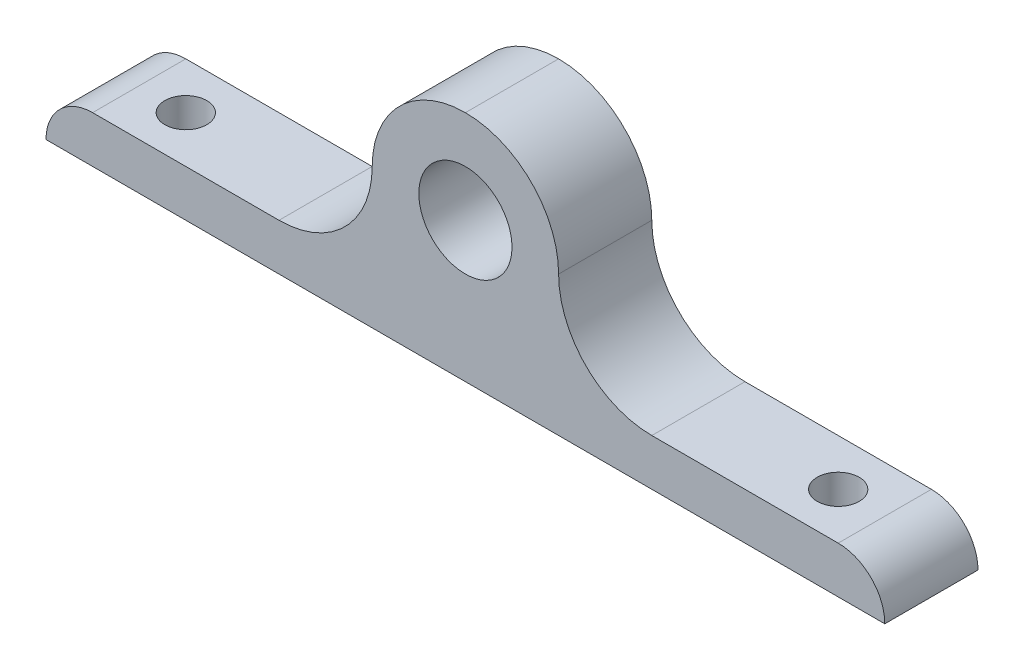
ISO-10303-21;
HEADER;
FILE_DESCRIPTION(('STEP AP214'),'2;1');
FILE_NAME('part.step','',(''),(''),'','','');
FILE_SCHEMA(('AUTOMOTIVE_DESIGN { 1 0 10303 214 1 1 1 1 }'));
ENDSEC;
DATA;
#1=APPLICATION_CONTEXT('core data for automotive mechanical design processes');
#2=APPLICATION_PROTOCOL_DEFINITION('international standard','automotive_design',2000,#1);
#3=PRODUCT_CONTEXT('',#1,'mechanical');
#4=PRODUCT('Part','Part','',(#3));
#5=PRODUCT_RELATED_PRODUCT_CATEGORY('part','',(#4));
#6=PRODUCT_DEFINITION_FORMATION('','',#4);
#7=PRODUCT_DEFINITION_CONTEXT('part definition',#1,'design');
#8=PRODUCT_DEFINITION('design','',#6,#7);
#9=PRODUCT_DEFINITION_SHAPE('','',#8);
#10=(LENGTH_UNIT() NAMED_UNIT(*) SI_UNIT(.MILLI.,.METRE.));
#11=(NAMED_UNIT(*) PLANE_ANGLE_UNIT() SI_UNIT($,.RADIAN.));
#12=(NAMED_UNIT(*) SI_UNIT($,.STERADIAN.) SOLID_ANGLE_UNIT());
#13=UNCERTAINTY_MEASURE_WITH_UNIT(LENGTH_MEASURE(1.E-05),#10,'distance_accuracy_value','');
#14=(GEOMETRIC_REPRESENTATION_CONTEXT(3) GLOBAL_UNCERTAINTY_ASSIGNED_CONTEXT((#13)) GLOBAL_UNIT_ASSIGNED_CONTEXT((#10,
#11,#12)) REPRESENTATION_CONTEXT('',''));
#15=CARTESIAN_POINT('',(0.,0.,0.));
#16=DIRECTION('',(0.,0.,1.));
#17=DIRECTION('',(1.,0.,0.));
#18=AXIS2_PLACEMENT_3D('',#15,#16,#17);
#19=CARTESIAN_POINT('',(0.,0.,10.));
#20=DIRECTION('',(0.,0.,1.));
#21=DIRECTION('',(1.,0.,0.));
#22=AXIS2_PLACEMENT_3D('',#19,#20,#21);
#23=PLANE('',#22);
#24=DIRECTION('',(1.,0.,0.));
#25=VECTOR('',#24,1.);
#26=CARTESIAN_POINT('',(-45.,-15.,10.));
#27=LINE('',#26,#25);
#28=CARTESIAN_POINT('',(-45.,-15.,10.));
#29=VERTEX_POINT('',#28);
#30=CARTESIAN_POINT('',(45.,-15.,10.));
#31=VERTEX_POINT('',#30);
#32=EDGE_CURVE('E107',#29,#31,#27,.T.);
#33=ORIENTED_EDGE('',*,*,#32,.T.);
#34=CARTESIAN_POINT('',(40.,-15.,10.));
#35=DIRECTION('',(0.,0.,1.));
#36=DIRECTION('',(1.,0.,0.));
#37=AXIS2_PLACEMENT_3D('',#34,#35,#36);
#38=CIRCLE('',#37,5.);
#39=CARTESIAN_POINT('',(40.,-10.,10.));
#40=VERTEX_POINT('',#39);
#41=EDGE_CURVE('E42',#31,#40,#38,.T.);
#42=ORIENTED_EDGE('',*,*,#41,.T.);
#43=DIRECTION('',(-1.,0.,0.));
#44=VECTOR('',#43,1.);
#45=CARTESIAN_POINT('',(10.,-10.,10.));
#46=LINE('',#45,#44);
#47=CARTESIAN_POINT('',(20.,-10.,10.));
#48=VERTEX_POINT('',#47);
#49=EDGE_CURVE('E122',#40,#48,#46,.T.);
#50=ORIENTED_EDGE('',*,*,#49,.T.);
#51=CARTESIAN_POINT('',(20.,0.,10.));
#52=DIRECTION('',(0.,0.,1.));
#53=DIRECTION('',(1.,0.,0.));
#54=AXIS2_PLACEMENT_3D('',#51,#52,#53);
#55=CIRCLE('',#54,10.);
#56=CARTESIAN_POINT('',(10.,0.,10.));
#57=VERTEX_POINT('',#56);
#58=EDGE_CURVE('E144',#48,#57,#55,.F.);
#59=ORIENTED_EDGE('',*,*,#58,.T.);
#60=CARTESIAN_POINT('',(0.,0.,10.));
#61=DIRECTION('',(0.,0.,1.));
#62=DIRECTION('',(1.,0.,0.));
#63=AXIS2_PLACEMENT_3D('',#60,#61,#62);
#64=CIRCLE('',#63,10.);
#65=CARTESIAN_POINT('',(0.,10.,10.));
#66=VERTEX_POINT('',#65);
#67=EDGE_CURVE('E139',#57,#66,#64,.T.);
#68=ORIENTED_EDGE('',*,*,#67,.T.);
#69=CARTESIAN_POINT('',(0.,0.,10.));
#70=DIRECTION('',(0.,0.,1.));
#71=DIRECTION('',(1.,0.,0.));
#72=AXIS2_PLACEMENT_3D('',#69,#70,#71);
#73=CIRCLE('',#72,10.);
#74=CARTESIAN_POINT('',(-10.,0.,10.));
#75=VERTEX_POINT('',#74);
#76=EDGE_CURVE('E137',#66,#75,#73,.T.);
#77=ORIENTED_EDGE('',*,*,#76,.T.);
#78=CARTESIAN_POINT('',(-20.,0.,10.));
#79=DIRECTION('',(0.,0.,1.));
#80=DIRECTION('',(1.,0.,0.));
#81=AXIS2_PLACEMENT_3D('',#78,#79,#80);
#82=CIRCLE('',#81,10.);
#83=CARTESIAN_POINT('',(-20.,-10.,10.));
#84=VERTEX_POINT('',#83);
#85=EDGE_CURVE('E148',#75,#84,#82,.F.);
#86=ORIENTED_EDGE('',*,*,#85,.T.);
#87=DIRECTION('',(-1.,0.,0.));
#88=VECTOR('',#87,1.);
#89=CARTESIAN_POINT('',(-45.,-10.,10.));
#90=LINE('',#89,#88);
#91=CARTESIAN_POINT('',(-40.,-10.,10.));
#92=VERTEX_POINT('',#91);
#93=EDGE_CURVE('E109',#84,#92,#90,.T.);
#94=ORIENTED_EDGE('',*,*,#93,.T.);
#95=CARTESIAN_POINT('',(-40.,-15.,10.));
#96=DIRECTION('',(0.,0.,1.));
#97=DIRECTION('',(1.,0.,0.));
#98=AXIS2_PLACEMENT_3D('',#95,#96,#97);
#99=CIRCLE('',#98,5.);
#100=EDGE_CURVE('E104',#92,#29,#99,.T.);
#101=ORIENTED_EDGE('',*,*,#100,.T.);
#102=EDGE_LOOP('',(#33,#42,#50,#59,#68,#77,#86,#94,#101));
#103=FACE_BOUND('',#102,.T.);
#104=CARTESIAN_POINT('',(0.,0.,10.));
#105=DIRECTION('',(0.,0.,1.));
#106=DIRECTION('',(1.,0.,0.));
#107=AXIS2_PLACEMENT_3D('',#104,#105,#106);
#108=CIRCLE('',#107,5.);
#109=CARTESIAN_POINT('',(5.,0.,10.));
#110=VERTEX_POINT('',#109);
#111=EDGE_CURVE('E181',#110,#110,#108,.T.);
#112=ORIENTED_EDGE('',*,*,#111,.F.);
#113=EDGE_LOOP('',(#112));
#114=FACE_BOUND('',#113,.T.);
#115=ADVANCED_FACE('F34',(#103,#114),#23,.T.);
#116=CARTESIAN_POINT('',(0.,0.,0.));
#117=DIRECTION('',(0.,0.,1.));
#118=DIRECTION('',(1.,0.,0.));
#119=AXIS2_PLACEMENT_3D('',#116,#117,#118);
#120=PLANE('',#119);
#121=DIRECTION('',(-1.,0.,0.));
#122=VECTOR('',#121,1.);
#123=CARTESIAN_POINT('',(10.,-10.,0.));
#124=LINE('',#123,#122);
#125=CARTESIAN_POINT('',(40.,-10.,0.));
#126=VERTEX_POINT('',#125);
#127=CARTESIAN_POINT('',(20.,-10.,0.));
#128=VERTEX_POINT('',#127);
#129=EDGE_CURVE('E178',#126,#128,#124,.T.);
#130=ORIENTED_EDGE('',*,*,#129,.F.);
#131=CARTESIAN_POINT('',(40.,-15.,0.));
#132=DIRECTION('',(0.,0.,1.));
#133=DIRECTION('',(1.,0.,0.));
#134=AXIS2_PLACEMENT_3D('',#131,#132,#133);
#135=CIRCLE('',#134,5.);
#136=CARTESIAN_POINT('',(45.,-15.,0.));
#137=VERTEX_POINT('',#136);
#138=EDGE_CURVE('E112',#126,#137,#135,.F.);
#139=ORIENTED_EDGE('',*,*,#138,.T.);
#140=DIRECTION('',(1.,0.,0.));
#141=VECTOR('',#140,1.);
#142=CARTESIAN_POINT('',(-45.,-15.,0.));
#143=LINE('',#142,#141);
#144=CARTESIAN_POINT('',(-45.,-15.,0.));
#145=VERTEX_POINT('',#144);
#146=EDGE_CURVE('E177',#145,#137,#143,.T.);
#147=ORIENTED_EDGE('',*,*,#146,.F.);
#148=CARTESIAN_POINT('',(-40.,-15.,0.));
#149=DIRECTION('',(0.,0.,1.));
#150=DIRECTION('',(1.,0.,0.));
#151=AXIS2_PLACEMENT_3D('',#148,#149,#150);
#152=CIRCLE('',#151,5.);
#153=CARTESIAN_POINT('',(-40.,-10.,0.));
#154=VERTEX_POINT('',#153);
#155=EDGE_CURVE('E55',#145,#154,#152,.F.);
#156=ORIENTED_EDGE('',*,*,#155,.T.);
#157=DIRECTION('',(-1.,0.,0.));
#158=VECTOR('',#157,1.);
#159=CARTESIAN_POINT('',(-45.,-10.,0.));
#160=LINE('',#159,#158);
#161=CARTESIAN_POINT('',(-20.,-10.,0.));
#162=VERTEX_POINT('',#161);
#163=EDGE_CURVE('E179',#162,#154,#160,.T.);
#164=ORIENTED_EDGE('',*,*,#163,.F.);
#165=CARTESIAN_POINT('',(-20.,0.,0.));
#166=DIRECTION('',(0.,0.,1.));
#167=DIRECTION('',(1.,0.,0.));
#168=AXIS2_PLACEMENT_3D('',#165,#166,#167);
#169=CIRCLE('',#168,10.);
#170=CARTESIAN_POINT('',(-10.,0.,0.));
#171=VERTEX_POINT('',#170);
#172=EDGE_CURVE('E146',#162,#171,#169,.T.);
#173=ORIENTED_EDGE('',*,*,#172,.T.);
#174=CARTESIAN_POINT('',(0.,0.,0.));
#175=DIRECTION('',(0.,0.,1.));
#176=DIRECTION('',(1.,0.,0.));
#177=AXIS2_PLACEMENT_3D('',#174,#175,#176);
#178=CIRCLE('',#177,10.);
#179=CARTESIAN_POINT('',(0.,10.,0.));
#180=VERTEX_POINT('',#179);
#181=EDGE_CURVE('E133',#171,#180,#178,.F.);
#182=ORIENTED_EDGE('',*,*,#181,.T.);
#183=CARTESIAN_POINT('',(0.,0.,0.));
#184=DIRECTION('',(0.,0.,1.));
#185=DIRECTION('',(1.,0.,0.));
#186=AXIS2_PLACEMENT_3D('',#183,#184,#185);
#187=CIRCLE('',#186,10.);
#188=CARTESIAN_POINT('',(10.,0.,0.));
#189=VERTEX_POINT('',#188);
#190=EDGE_CURVE('E135',#180,#189,#187,.F.);
#191=ORIENTED_EDGE('',*,*,#190,.T.);
#192=CARTESIAN_POINT('',(20.,0.,0.));
#193=DIRECTION('',(0.,0.,1.));
#194=DIRECTION('',(1.,0.,0.));
#195=AXIS2_PLACEMENT_3D('',#192,#193,#194);
#196=CIRCLE('',#195,10.);
#197=EDGE_CURVE('E141',#189,#128,#196,.T.);
#198=ORIENTED_EDGE('',*,*,#197,.T.);
#199=EDGE_LOOP('',(#130,#139,#147,#156,#164,#173,#182,#191,#198));
#200=FACE_BOUND('',#199,.T.);
#201=CARTESIAN_POINT('',(0.,0.,0.));
#202=DIRECTION('',(0.,0.,1.));
#203=DIRECTION('',(1.,0.,0.));
#204=AXIS2_PLACEMENT_3D('',#201,#202,#203);
#205=CIRCLE('',#204,5.);
#206=CARTESIAN_POINT('',(5.,0.,0.));
#207=VERTEX_POINT('',#206);
#208=EDGE_CURVE('E161',#207,#207,#205,.T.);
#209=ORIENTED_EDGE('',*,*,#208,.T.);
#210=EDGE_LOOP('',(#209));
#211=FACE_BOUND('',#210,.T.);
#212=ADVANCED_FACE('F175',(#200,#211),#120,.F.);
#213=CARTESIAN_POINT('',(-45.,-10.,10.));
#214=DIRECTION('',(0.,-1.,0.));
#215=DIRECTION('',(0.,0.,-1.));
#216=AXIS2_PLACEMENT_3D('',#213,#214,#215);
#217=PLANE('',#216);
#218=CARTESIAN_POINT('',(-35.,-10.,5.));
#219=DIRECTION('',(0.,1.,0.));
#220=DIRECTION('',(0.,0.,1.));
#221=AXIS2_PLACEMENT_3D('',#218,#219,#220);
#222=CIRCLE('',#221,2.25);
#223=CARTESIAN_POINT('',(-35.,-10.,7.25));
#224=VERTEX_POINT('',#223);
#225=EDGE_CURVE('E197',#224,#224,#222,.T.);
#226=ORIENTED_EDGE('',*,*,#225,.F.);
#227=EDGE_LOOP('',(#226));
#228=FACE_BOUND('',#227,.T.);
#229=ORIENTED_EDGE('',*,*,#163,.T.);
#230=DIRECTION('',(0.,0.,-1.));
#231=VECTOR('',#230,1.);
#232=CARTESIAN_POINT('',(-40.,-10.,10.));
#233=LINE('',#232,#231);
#234=EDGE_CURVE('E11',#154,#92,#233,.F.);
#235=ORIENTED_EDGE('',*,*,#234,.T.);
#236=ORIENTED_EDGE('',*,*,#93,.F.);
#237=DIRECTION('',(0.,0.,-1.));
#238=VECTOR('',#237,1.);
#239=CARTESIAN_POINT('',(-20.,-10.,0.));
#240=LINE('',#239,#238);
#241=EDGE_CURVE('E127',#84,#162,#240,.T.);
#242=ORIENTED_EDGE('',*,*,#241,.T.);
#243=EDGE_LOOP('',(#229,#235,#236,#242));
#244=FACE_BOUND('',#243,.T.);
#245=ADVANCED_FACE('F203',(#228,#244),#217,.F.);
#246=CARTESIAN_POINT('',(-45.,-15.,10.));
#247=DIRECTION('',(0.,1.,0.));
#248=DIRECTION('',(0.,0.,1.));
#249=AXIS2_PLACEMENT_3D('',#246,#247,#248);
#250=PLANE('',#249);
#251=CARTESIAN_POINT('',(-35.,-15.,5.));
#252=DIRECTION('',(0.,1.,0.));
#253=DIRECTION('',(0.,0.,1.));
#254=AXIS2_PLACEMENT_3D('',#251,#252,#253);
#255=CIRCLE('',#254,2.25);
#256=CARTESIAN_POINT('',(-35.,-15.,7.25));
#257=VERTEX_POINT('',#256);
#258=EDGE_CURVE('E194',#257,#257,#255,.T.);
#259=ORIENTED_EDGE('',*,*,#258,.T.);
#260=EDGE_LOOP('',(#259));
#261=FACE_BOUND('',#260,.T.);
#262=CARTESIAN_POINT('',(35.,-15.,5.));
#263=DIRECTION('',(0.,1.,0.));
#264=DIRECTION('',(0.,0.,1.));
#265=AXIS2_PLACEMENT_3D('',#262,#263,#264);
#266=CIRCLE('',#265,2.25);
#267=CARTESIAN_POINT('',(35.,-15.,7.25));
#268=VERTEX_POINT('',#267);
#269=EDGE_CURVE('E155',#268,#268,#266,.T.);
#270=ORIENTED_EDGE('',*,*,#269,.T.);
#271=EDGE_LOOP('',(#270));
#272=FACE_BOUND('',#271,.T.);
#273=ORIENTED_EDGE('',*,*,#146,.T.);
#274=DIRECTION('',(0.,0.,-1.));
#275=VECTOR('',#274,1.);
#276=CARTESIAN_POINT('',(45.,-15.,10.));
#277=LINE('',#276,#275);
#278=EDGE_CURVE('E120',#31,#137,#277,.T.);
#279=ORIENTED_EDGE('',*,*,#278,.F.);
#280=ORIENTED_EDGE('',*,*,#32,.F.);
#281=DIRECTION('',(0.,0.,-1.));
#282=VECTOR('',#281,1.);
#283=CARTESIAN_POINT('',(-45.,-15.,10.));
#284=LINE('',#283,#282);
#285=EDGE_CURVE('E118',#29,#145,#284,.T.);
#286=ORIENTED_EDGE('',*,*,#285,.T.);
#287=EDGE_LOOP('',(#273,#279,#280,#286));
#288=FACE_BOUND('',#287,.T.);
#289=ADVANCED_FACE('F117',(#261,#272,#288),#250,.F.);
#290=CARTESIAN_POINT('',(10.,-10.,10.));
#291=DIRECTION('',(0.,-1.,0.));
#292=DIRECTION('',(0.,0.,-1.));
#293=AXIS2_PLACEMENT_3D('',#290,#291,#292);
#294=PLANE('',#293);
#295=CARTESIAN_POINT('',(35.,-10.,5.));
#296=DIRECTION('',(0.,1.,0.));
#297=DIRECTION('',(0.,0.,1.));
#298=AXIS2_PLACEMENT_3D('',#295,#296,#297);
#299=CIRCLE('',#298,2.25);
#300=CARTESIAN_POINT('',(35.,-10.,7.25));
#301=VERTEX_POINT('',#300);
#302=EDGE_CURVE('E191',#301,#301,#299,.T.);
#303=ORIENTED_EDGE('',*,*,#302,.F.);
#304=EDGE_LOOP('',(#303));
#305=FACE_BOUND('',#304,.T.);
#306=ORIENTED_EDGE('',*,*,#49,.F.);
#307=DIRECTION('',(0.,0.,-1.));
#308=VECTOR('',#307,1.);
#309=CARTESIAN_POINT('',(40.,-10.,10.));
#310=LINE('',#309,#308);
#311=EDGE_CURVE('E150',#40,#126,#310,.T.);
#312=ORIENTED_EDGE('',*,*,#311,.T.);
#313=ORIENTED_EDGE('',*,*,#129,.T.);
#314=DIRECTION('',(0.,0.,-1.));
#315=VECTOR('',#314,1.);
#316=CARTESIAN_POINT('',(20.,-10.,10.));
#317=LINE('',#316,#315);
#318=EDGE_CURVE('E124',#128,#48,#317,.F.);
#319=ORIENTED_EDGE('',*,*,#318,.T.);
#320=EDGE_LOOP('',(#306,#312,#313,#319));
#321=FACE_BOUND('',#320,.T.);
#322=ADVANCED_FACE('F170',(#305,#321),#294,.F.);
#323=CARTESIAN_POINT('',(0.,0.,10.));
#324=DIRECTION('',(0.,0.,-1.));
#325=DIRECTION('',(-1.,0.,0.));
#326=AXIS2_PLACEMENT_3D('',#323,#324,#325);
#327=CYLINDRICAL_SURFACE('',#326,5.);
#328=ORIENTED_EDGE('',*,*,#111,.T.);
#329=EDGE_LOOP('',(#328));
#330=FACE_BOUND('',#329,.T.);
#331=ORIENTED_EDGE('',*,*,#208,.F.);
#332=EDGE_LOOP('',(#331));
#333=FACE_BOUND('',#332,.T.);
#334=ADVANCED_FACE('F242',(#330,#333),#327,.F.);
#335=CARTESIAN_POINT('',(-20.,0.,10.));
#336=DIRECTION('',(0.,0.,1.));
#337=DIRECTION('',(1.,0.,0.));
#338=AXIS2_PLACEMENT_3D('',#335,#336,#337);
#339=CYLINDRICAL_SURFACE('',#338,10.);
#340=ORIENTED_EDGE('',*,*,#241,.F.);
#341=ORIENTED_EDGE('',*,*,#85,.F.);
#342=DIRECTION('',(0.,0.,-1.));
#343=VECTOR('',#342,1.);
#344=CARTESIAN_POINT('',(-10.,0.,10.));
#345=LINE('',#344,#343);
#346=EDGE_CURVE('E158',#171,#75,#345,.F.);
#347=ORIENTED_EDGE('',*,*,#346,.F.);
#348=ORIENTED_EDGE('',*,*,#172,.F.);
#349=EDGE_LOOP('',(#340,#341,#347,#348));
#350=FACE_BOUND('',#349,.T.);
#351=ADVANCED_FACE('F210',(#350),#339,.F.);
#352=CARTESIAN_POINT('',(0.,0.,10.));
#353=DIRECTION('',(0.,0.,-1.));
#354=DIRECTION('',(-1.,0.,0.));
#355=AXIS2_PLACEMENT_3D('',#352,#353,#354);
#356=CYLINDRICAL_SURFACE('',#355,10.);
#357=ORIENTED_EDGE('',*,*,#346,.T.);
#358=ORIENTED_EDGE('',*,*,#76,.F.);
#359=DIRECTION('',(0.,0.,-1.));
#360=VECTOR('',#359,1.);
#361=CARTESIAN_POINT('',(0.,10.,10.));
#362=LINE('',#361,#360);
#363=EDGE_CURVE('E154',#180,#66,#362,.F.);
#364=ORIENTED_EDGE('',*,*,#363,.F.);
#365=ORIENTED_EDGE('',*,*,#181,.F.);
#366=EDGE_LOOP('',(#357,#358,#364,#365));
#367=FACE_BOUND('',#366,.T.);
#368=ADVANCED_FACE('F216',(#367),#356,.T.);
#369=CARTESIAN_POINT('',(0.,0.,10.));
#370=DIRECTION('',(0.,0.,-1.));
#371=DIRECTION('',(-1.,0.,0.));
#372=AXIS2_PLACEMENT_3D('',#369,#370,#371);
#373=CYLINDRICAL_SURFACE('',#372,10.);
#374=ORIENTED_EDGE('',*,*,#363,.T.);
#375=ORIENTED_EDGE('',*,*,#67,.F.);
#376=DIRECTION('',(0.,0.,-1.));
#377=VECTOR('',#376,1.);
#378=CARTESIAN_POINT('',(10.,0.,10.));
#379=LINE('',#378,#377);
#380=EDGE_CURVE('E151',#189,#57,#379,.F.);
#381=ORIENTED_EDGE('',*,*,#380,.F.);
#382=ORIENTED_EDGE('',*,*,#190,.F.);
#383=EDGE_LOOP('',(#374,#375,#381,#382));
#384=FACE_BOUND('',#383,.T.);
#385=ADVANCED_FACE('F222',(#384),#373,.T.);
#386=CARTESIAN_POINT('',(20.,0.,10.));
#387=DIRECTION('',(0.,0.,1.));
#388=DIRECTION('',(1.,0.,0.));
#389=AXIS2_PLACEMENT_3D('',#386,#387,#388);
#390=CYLINDRICAL_SURFACE('',#389,10.);
#391=ORIENTED_EDGE('',*,*,#58,.F.);
#392=ORIENTED_EDGE('',*,*,#318,.F.);
#393=ORIENTED_EDGE('',*,*,#197,.F.);
#394=ORIENTED_EDGE('',*,*,#380,.T.);
#395=EDGE_LOOP('',(#391,#392,#393,#394));
#396=FACE_BOUND('',#395,.T.);
#397=ADVANCED_FACE('F224',(#396),#390,.F.);
#398=CARTESIAN_POINT('',(35.,-10.,5.));
#399=DIRECTION('',(0.,1.,0.));
#400=DIRECTION('',(0.,0.,1.));
#401=AXIS2_PLACEMENT_3D('',#398,#399,#400);
#402=CYLINDRICAL_SURFACE('',#401,2.25);
#403=ORIENTED_EDGE('',*,*,#269,.F.);
#404=EDGE_LOOP('',(#403));
#405=FACE_BOUND('',#404,.T.);
#406=ORIENTED_EDGE('',*,*,#302,.T.);
#407=EDGE_LOOP('',(#406));
#408=FACE_BOUND('',#407,.T.);
#409=ADVANCED_FACE('F226',(#405,#408),#402,.F.);
#410=CARTESIAN_POINT('',(-35.,-10.,5.));
#411=DIRECTION('',(0.,1.,0.));
#412=DIRECTION('',(0.,0.,1.));
#413=AXIS2_PLACEMENT_3D('',#410,#411,#412);
#414=CYLINDRICAL_SURFACE('',#413,2.25);
#415=ORIENTED_EDGE('',*,*,#258,.F.);
#416=EDGE_LOOP('',(#415));
#417=FACE_BOUND('',#416,.T.);
#418=ORIENTED_EDGE('',*,*,#225,.T.);
#419=EDGE_LOOP('',(#418));
#420=FACE_BOUND('',#419,.T.);
#421=ADVANCED_FACE('F201',(#417,#420),#414,.F.);
#422=CARTESIAN_POINT('',(40.,-15.,10.));
#423=DIRECTION('',(0.,0.,-1.));
#424=DIRECTION('',(-1.,0.,0.));
#425=AXIS2_PLACEMENT_3D('',#422,#423,#424);
#426=CYLINDRICAL_SURFACE('',#425,5.);
#427=ORIENTED_EDGE('',*,*,#41,.F.);
#428=ORIENTED_EDGE('',*,*,#278,.T.);
#429=ORIENTED_EDGE('',*,*,#138,.F.);
#430=ORIENTED_EDGE('',*,*,#311,.F.);
#431=EDGE_LOOP('',(#427,#428,#429,#430));
#432=FACE_BOUND('',#431,.T.);
#433=ADVANCED_FACE('F174',(#432),#426,.T.);
#434=CARTESIAN_POINT('',(-40.,-15.,10.));
#435=DIRECTION('',(0.,0.,-1.));
#436=DIRECTION('',(-1.,0.,0.));
#437=AXIS2_PLACEMENT_3D('',#434,#435,#436);
#438=CYLINDRICAL_SURFACE('',#437,5.);
#439=ORIENTED_EDGE('',*,*,#100,.F.);
#440=ORIENTED_EDGE('',*,*,#234,.F.);
#441=ORIENTED_EDGE('',*,*,#155,.F.);
#442=ORIENTED_EDGE('',*,*,#285,.F.);
#443=EDGE_LOOP('',(#439,#440,#441,#442));
#444=FACE_BOUND('',#443,.T.);
#445=ADVANCED_FACE('F36',(#444),#438,.T.);
#446=CLOSED_SHELL('',(#115,#212,#245,#289,#322,#334,#351,#368,#385,#397,#409,#421,#433,#445));
#447=MANIFOLD_SOLID_BREP('B2',#446);
#448=ADVANCED_BREP_SHAPE_REPRESENTATION('',(#18,#447),#14);
#449=SHAPE_DEFINITION_REPRESENTATION(#9,#448);
ENDSEC;
END-ISO-10303-21;
